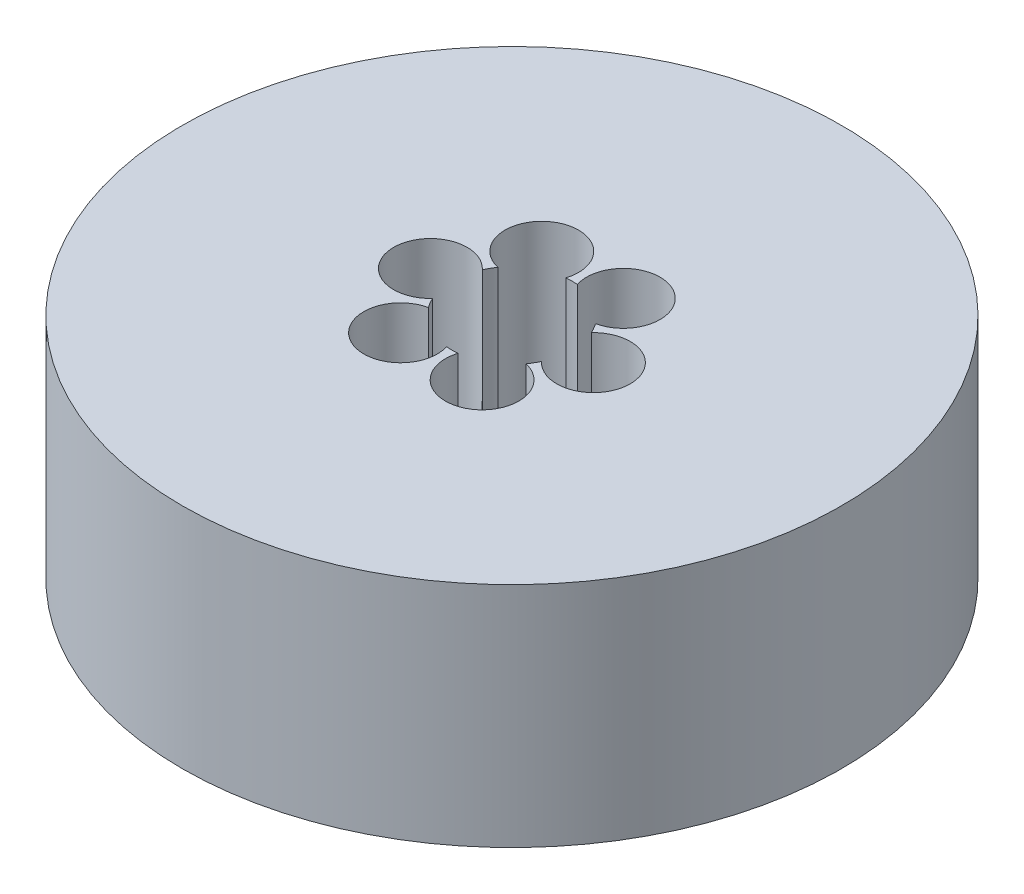
ISO-10303-21;
HEADER;
FILE_DESCRIPTION(('STEP AP214'),'2;1');
FILE_NAME('part.step','',(''),(''),'','','');
FILE_SCHEMA(('AUTOMOTIVE_DESIGN { 1 0 10303 214 1 1 1 1 }'));
ENDSEC;
DATA;
#1=APPLICATION_CONTEXT('core data for automotive mechanical design processes');
#2=APPLICATION_PROTOCOL_DEFINITION('international standard','automotive_design',2000,#1);
#3=PRODUCT_CONTEXT('',#1,'mechanical');
#4=PRODUCT('Part','Part','',(#3));
#5=PRODUCT_RELATED_PRODUCT_CATEGORY('part','',(#4));
#6=PRODUCT_DEFINITION_FORMATION('','',#4);
#7=PRODUCT_DEFINITION_CONTEXT('part definition',#1,'design');
#8=PRODUCT_DEFINITION('design','',#6,#7);
#9=PRODUCT_DEFINITION_SHAPE('','',#8);
#10=(LENGTH_UNIT() NAMED_UNIT(*) SI_UNIT(.MILLI.,.METRE.));
#11=(NAMED_UNIT(*) PLANE_ANGLE_UNIT() SI_UNIT($,.RADIAN.));
#12=(NAMED_UNIT(*) SI_UNIT($,.STERADIAN.) SOLID_ANGLE_UNIT());
#13=UNCERTAINTY_MEASURE_WITH_UNIT(LENGTH_MEASURE(1.E-05),#10,'distance_accuracy_value','');
#14=(GEOMETRIC_REPRESENTATION_CONTEXT(3) GLOBAL_UNCERTAINTY_ASSIGNED_CONTEXT((#13)) GLOBAL_UNIT_ASSIGNED_CONTEXT((#10,
#11,#12)) REPRESENTATION_CONTEXT('',''));
#15=CARTESIAN_POINT('',(0.,0.,0.));
#16=DIRECTION('',(0.,0.,1.));
#17=DIRECTION('',(1.,0.,0.));
#18=AXIS2_PLACEMENT_3D('',#15,#16,#17);
#19=CARTESIAN_POINT('',(0.,19.,0.));
#20=DIRECTION('',(0.,-1.,0.));
#21=DIRECTION('',(0.,0.,-1.));
#22=AXIS2_PLACEMENT_3D('',#19,#20,#21);
#23=CYLINDRICAL_SURFACE('',#22,27.5);
#24=CARTESIAN_POINT('',(0.,19.,0.));
#25=DIRECTION('',(0.,1.,0.));
#26=DIRECTION('',(0.,0.,1.));
#27=AXIS2_PLACEMENT_3D('',#24,#25,#26);
#28=CIRCLE('',#27,27.5);
#29=CARTESIAN_POINT('',(0.,19.,27.5));
#30=VERTEX_POINT('',#29);
#31=EDGE_CURVE('E168',#30,#30,#28,.T.);
#32=ORIENTED_EDGE('',*,*,#31,.F.);
#33=EDGE_LOOP('',(#32));
#34=FACE_BOUND('',#33,.T.);
#35=CARTESIAN_POINT('',(0.,0.,0.));
#36=DIRECTION('',(0.,1.,0.));
#37=DIRECTION('',(0.,0.,1.));
#38=AXIS2_PLACEMENT_3D('',#35,#36,#37);
#39=CIRCLE('',#38,27.5);
#40=CARTESIAN_POINT('',(0.,0.,27.5));
#41=VERTEX_POINT('',#40);
#42=EDGE_CURVE('E158',#41,#41,#39,.T.);
#43=ORIENTED_EDGE('',*,*,#42,.T.);
#44=EDGE_LOOP('',(#43));
#45=FACE_BOUND('',#44,.T.);
#46=ADVANCED_FACE('F39',(#34,#45),#23,.T.);
#47=CARTESIAN_POINT('',(0.,19.,0.));
#48=DIRECTION('',(0.,1.,0.));
#49=DIRECTION('',(0.,0.,1.));
#50=AXIS2_PLACEMENT_3D('',#47,#48,#49);
#51=PLANE('',#50);
#52=CARTESIAN_POINT('',(6.80324282315777,19.,0.));
#53=DIRECTION('',(0.,1.,0.));
#54=DIRECTION('',(0.,0.,-1.));
#55=AXIS2_PLACEMENT_3D('',#52,#53,#54);
#56=CIRCLE('',#55,3.06638386982698);
#57=CARTESIAN_POINT('',(4.5479343073771,19.,2.07756914103534));
#58=VERTEX_POINT('',#57);
#59=CARTESIAN_POINT('',(4.5479343073771,19.,-2.07756914103534));
#60=VERTEX_POINT('',#59);
#61=EDGE_CURVE('E212',#58,#60,#56,.T.);
#62=ORIENTED_EDGE('',*,*,#61,.F.);
#63=CARTESIAN_POINT('',(0.,19.,0.));
#64=DIRECTION('',(0.,1.,0.));
#65=DIRECTION('',(0.,0.,1.));
#66=AXIS2_PLACEMENT_3D('',#63,#64,#65);
#67=CIRCLE('',#66,5.);
#68=CARTESIAN_POINT('',(4.07319480794379,19.,2.89984207441367));
#69=VERTEX_POINT('',#68);
#70=EDGE_CURVE('E156',#69,#58,#67,.T.);
#71=ORIENTED_EDGE('',*,*,#70,.F.);
#72=CARTESIAN_POINT('',(3.40162141157891,19.,5.89178111296877));
#73=DIRECTION('',(0.,1.,0.));
#74=DIRECTION('',(0.866025403784436,0.,-0.500000000000004));
#75=AXIS2_PLACEMENT_3D('',#72,#73,#74);
#76=CIRCLE('',#75,3.06638386982698);
#77=CARTESIAN_POINT('',(0.474739499433353,19.,4.97741121544903));
#78=VERTEX_POINT('',#77);
#79=EDGE_CURVE('E152',#78,#69,#76,.T.);
#80=ORIENTED_EDGE('',*,*,#79,.F.);
#81=CARTESIAN_POINT('',(-0.474739499433319,19.,4.97741121544903));
#82=VERTEX_POINT('',#81);
#83=EDGE_CURVE('E148',#82,#78,#67,.T.);
#84=ORIENTED_EDGE('',*,*,#83,.F.);
#85=CARTESIAN_POINT('',(-3.40162141157887,19.,5.8917811129688));
#86=DIRECTION('',(0.,1.,0.));
#87=DIRECTION('',(0.86602540378444,0.,0.499999999999998));
#88=AXIS2_PLACEMENT_3D('',#85,#86,#87);
#89=CIRCLE('',#88,3.06638386982698);
#90=CARTESIAN_POINT('',(-4.07319480794377,19.,2.8998420744137));
#91=VERTEX_POINT('',#90);
#92=EDGE_CURVE('E127',#91,#82,#89,.T.);
#93=ORIENTED_EDGE('',*,*,#92,.F.);
#94=CARTESIAN_POINT('',(-4.5479343073771,19.,2.07756914103534));
#95=VERTEX_POINT('',#94);
#96=EDGE_CURVE('E154',#95,#91,#67,.T.);
#97=ORIENTED_EDGE('',*,*,#96,.F.);
#98=CARTESIAN_POINT('',(-6.80324282315777,19.,0.));
#99=DIRECTION('',(0.,1.,0.));
#100=DIRECTION('',(0.,0.,1.));
#101=AXIS2_PLACEMENT_3D('',#98,#99,#100);
#102=CIRCLE('',#101,3.06638386982698);
#103=CARTESIAN_POINT('',(-4.5479343073771,19.,-2.07756914103534));
#104=VERTEX_POINT('',#103);
#105=EDGE_CURVE('E163',#104,#95,#102,.T.);
#106=ORIENTED_EDGE('',*,*,#105,.F.);
#107=CARTESIAN_POINT('',(-4.07319480794381,19.,-2.89984207441364));
#108=VERTEX_POINT('',#107);
#109=EDGE_CURVE('E157',#108,#104,#67,.T.);
#110=ORIENTED_EDGE('',*,*,#109,.F.);
#111=CARTESIAN_POINT('',(-3.40162141157895,19.,-5.89178111296875));
#112=DIRECTION('',(0.,1.,0.));
#113=DIRECTION('',(-0.866025403784433,0.,0.50000000000001));
#114=AXIS2_PLACEMENT_3D('',#111,#112,#113);
#115=CIRCLE('',#114,3.06638386982698);
#116=CARTESIAN_POINT('',(-0.474739499433388,19.,-4.97741121544902));
#117=VERTEX_POINT('',#116);
#118=EDGE_CURVE('E371',#117,#108,#115,.T.);
#119=ORIENTED_EDGE('',*,*,#118,.F.);
#120=CARTESIAN_POINT('',(0.474739499433283,19.,-4.97741121544903));
#121=VERTEX_POINT('',#120);
#122=EDGE_CURVE('E378',#121,#117,#67,.T.);
#123=ORIENTED_EDGE('',*,*,#122,.F.);
#124=CARTESIAN_POINT('',(3.40162141157883,19.,-5.89178111296882));
#125=DIRECTION('',(0.,1.,0.));
#126=DIRECTION('',(-0.866025403784443,0.,-0.499999999999992));
#127=AXIS2_PLACEMENT_3D('',#124,#125,#126);
#128=CIRCLE('',#127,3.06638386982698);
#129=CARTESIAN_POINT('',(4.07319480794375,19.,-2.89984207441372));
#130=VERTEX_POINT('',#129);
#131=EDGE_CURVE('E392',#130,#121,#128,.T.);
#132=ORIENTED_EDGE('',*,*,#131,.F.);
#133=EDGE_CURVE('E161',#60,#130,#67,.T.);
#134=ORIENTED_EDGE('',*,*,#133,.F.);
#135=EDGE_LOOP('',(#62,#71,#80,#84,#93,#97,#106,#110,#119,#123,#132,#134));
#136=FACE_BOUND('',#135,.T.);
#137=ORIENTED_EDGE('',*,*,#31,.T.);
#138=EDGE_LOOP('',(#137));
#139=FACE_BOUND('',#138,.T.);
#140=ADVANCED_FACE('F151',(#136,#139),#51,.T.);
#141=CARTESIAN_POINT('',(0.,0.,0.));
#142=DIRECTION('',(0.,1.,0.));
#143=DIRECTION('',(0.,0.,1.));
#144=AXIS2_PLACEMENT_3D('',#141,#142,#143);
#145=PLANE('',#144);
#146=CARTESIAN_POINT('',(0.,0.,0.));
#147=DIRECTION('',(0.,1.,0.));
#148=DIRECTION('',(0.,0.,1.));
#149=AXIS2_PLACEMENT_3D('',#146,#147,#148);
#150=CIRCLE('',#149,5.);
#151=CARTESIAN_POINT('',(0.,0.,5.));
#152=VERTEX_POINT('',#151);
#153=EDGE_CURVE('E167',#152,#152,#150,.T.);
#154=ORIENTED_EDGE('',*,*,#153,.T.);
#155=EDGE_LOOP('',(#154));
#156=FACE_BOUND('',#155,.T.);
#157=ORIENTED_EDGE('',*,*,#42,.F.);
#158=EDGE_LOOP('',(#157));
#159=FACE_BOUND('',#158,.T.);
#160=ADVANCED_FACE('F235',(#156,#159),#145,.F.);
#161=CARTESIAN_POINT('',(0.,19.,0.));
#162=DIRECTION('',(0.,-1.,0.));
#163=DIRECTION('',(0.,0.,-1.));
#164=AXIS2_PLACEMENT_3D('',#161,#162,#163);
#165=CYLINDRICAL_SURFACE('',#164,5.);
#166=DIRECTION('',(0.,1.,0.));
#167=VECTOR('',#166,1.);
#168=CARTESIAN_POINT('',(4.5479343073771,10.8844741258261,2.07756914103534));
#169=LINE('',#168,#167);
#170=CARTESIAN_POINT('',(4.5479343073771,2.76894825165226,2.07756914103534));
#171=VERTEX_POINT('',#170);
#172=EDGE_CURVE('E11',#171,#58,#169,.T.);
#173=ORIENTED_EDGE('',*,*,#172,.F.);
#174=CARTESIAN_POINT('',(0.,2.76894825165226,0.));
#175=DIRECTION('',(0.,1.,0.));
#176=DIRECTION('',(0.,0.,1.));
#177=AXIS2_PLACEMENT_3D('',#174,#175,#176);
#178=CIRCLE('',#177,5.);
#179=CARTESIAN_POINT('',(4.5479343073771,2.76894825165226,-2.07756914103534));
#180=VERTEX_POINT('',#179);
#181=EDGE_CURVE('E207',#171,#180,#178,.T.);
#182=ORIENTED_EDGE('',*,*,#181,.T.);
#183=DIRECTION('',(0.,1.,0.));
#184=VECTOR('',#183,1.);
#185=CARTESIAN_POINT('',(4.5479343073771,10.8844741258261,-2.07756914103534));
#186=LINE('',#185,#184);
#187=EDGE_CURVE('E46',#60,#180,#186,.F.);
#188=ORIENTED_EDGE('',*,*,#187,.F.);
#189=ORIENTED_EDGE('',*,*,#133,.T.);
#190=DIRECTION('',(0.,1.,0.));
#191=VECTOR('',#190,1.);
#192=CARTESIAN_POINT('',(4.07319480794375,10.8844741258261,-2.89984207441372));
#193=LINE('',#192,#191);
#194=CARTESIAN_POINT('',(4.07319480794375,2.76894825165226,-2.89984207441372));
#195=VERTEX_POINT('',#194);
#196=EDGE_CURVE('E199',#195,#130,#193,.T.);
#197=ORIENTED_EDGE('',*,*,#196,.F.);
#198=CARTESIAN_POINT('',(0.,2.76894825165226,0.));
#199=DIRECTION('',(0.,1.,0.));
#200=DIRECTION('',(0.,0.,1.));
#201=AXIS2_PLACEMENT_3D('',#198,#199,#200);
#202=CIRCLE('',#201,5.);
#203=CARTESIAN_POINT('',(0.474739499433283,2.76894825165226,-4.97741121544903));
#204=VERTEX_POINT('',#203);
#205=EDGE_CURVE('E193',#195,#204,#202,.T.);
#206=ORIENTED_EDGE('',*,*,#205,.T.);
#207=DIRECTION('',(0.,1.,0.));
#208=VECTOR('',#207,1.);
#209=CARTESIAN_POINT('',(0.474739499433283,10.8844741258261,-4.97741121544903));
#210=LINE('',#209,#208);
#211=EDGE_CURVE('E197',#121,#204,#210,.F.);
#212=ORIENTED_EDGE('',*,*,#211,.F.);
#213=ORIENTED_EDGE('',*,*,#122,.T.);
#214=DIRECTION('',(0.,1.,0.));
#215=VECTOR('',#214,1.);
#216=CARTESIAN_POINT('',(-0.474739499433387,10.8844741258261,-4.97741121544902));
#217=LINE('',#216,#215);
#218=CARTESIAN_POINT('',(-0.474739499433388,2.76894825165226,-4.97741121544902));
#219=VERTEX_POINT('',#218);
#220=EDGE_CURVE('E195',#219,#117,#217,.T.);
#221=ORIENTED_EDGE('',*,*,#220,.F.);
#222=CARTESIAN_POINT('',(0.,2.76894825165226,0.));
#223=DIRECTION('',(0.,1.,0.));
#224=DIRECTION('',(0.,0.,1.));
#225=AXIS2_PLACEMENT_3D('',#222,#223,#224);
#226=CIRCLE('',#225,5.);
#227=CARTESIAN_POINT('',(-4.07319480794381,2.76894825165226,-2.89984207441364));
#228=VERTEX_POINT('',#227);
#229=EDGE_CURVE('E186',#219,#228,#226,.T.);
#230=ORIENTED_EDGE('',*,*,#229,.T.);
#231=DIRECTION('',(0.,1.,0.));
#232=VECTOR('',#231,1.);
#233=CARTESIAN_POINT('',(-4.07319480794381,10.8844741258261,-2.89984207441364));
#234=LINE('',#233,#232);
#235=EDGE_CURVE('E188',#108,#228,#234,.F.);
#236=ORIENTED_EDGE('',*,*,#235,.F.);
#237=ORIENTED_EDGE('',*,*,#109,.T.);
#238=DIRECTION('',(0.,1.,0.));
#239=VECTOR('',#238,1.);
#240=CARTESIAN_POINT('',(-4.5479343073771,10.8844741258261,-2.07756914103534));
#241=LINE('',#240,#239);
#242=CARTESIAN_POINT('',(-4.5479343073771,2.76894825165226,-2.07756914103534));
#243=VERTEX_POINT('',#242);
#244=EDGE_CURVE('E182',#243,#104,#241,.T.);
#245=ORIENTED_EDGE('',*,*,#244,.F.);
#246=CARTESIAN_POINT('',(0.,2.76894825165226,0.));
#247=DIRECTION('',(0.,1.,0.));
#248=DIRECTION('',(0.,0.,1.));
#249=AXIS2_PLACEMENT_3D('',#246,#247,#248);
#250=CIRCLE('',#249,5.);
#251=CARTESIAN_POINT('',(-4.5479343073771,2.76894825165226,2.07756914103534));
#252=VERTEX_POINT('',#251);
#253=EDGE_CURVE('E172',#243,#252,#250,.T.);
#254=ORIENTED_EDGE('',*,*,#253,.T.);
#255=DIRECTION('',(0.,1.,0.));
#256=VECTOR('',#255,1.);
#257=CARTESIAN_POINT('',(-4.5479343073771,10.8844741258261,2.07756914103534));
#258=LINE('',#257,#256);
#259=EDGE_CURVE('E177',#95,#252,#258,.F.);
#260=ORIENTED_EDGE('',*,*,#259,.F.);
#261=ORIENTED_EDGE('',*,*,#96,.T.);
#262=DIRECTION('',(0.,1.,0.));
#263=VECTOR('',#262,1.);
#264=CARTESIAN_POINT('',(-4.07319480794377,10.8844741258261,2.8998420744137));
#265=LINE('',#264,#263);
#266=CARTESIAN_POINT('',(-4.07319480794377,2.76894825165226,2.8998420744137));
#267=VERTEX_POINT('',#266);
#268=EDGE_CURVE('E132',#267,#91,#265,.T.);
#269=ORIENTED_EDGE('',*,*,#268,.F.);
#270=CARTESIAN_POINT('',(0.,2.76894825165226,0.));
#271=DIRECTION('',(0.,1.,0.));
#272=DIRECTION('',(0.,0.,1.));
#273=AXIS2_PLACEMENT_3D('',#270,#271,#272);
#274=CIRCLE('',#273,5.);
#275=CARTESIAN_POINT('',(-0.474739499433319,2.76894825165226,4.97741121544903));
#276=VERTEX_POINT('',#275);
#277=EDGE_CURVE('E150',#267,#276,#274,.T.);
#278=ORIENTED_EDGE('',*,*,#277,.T.);
#279=DIRECTION('',(0.,1.,0.));
#280=VECTOR('',#279,1.);
#281=CARTESIAN_POINT('',(-0.474739499433318,10.8844741258261,4.97741121544903));
#282=LINE('',#281,#280);
#283=EDGE_CURVE('E128',#82,#276,#282,.F.);
#284=ORIENTED_EDGE('',*,*,#283,.F.);
#285=ORIENTED_EDGE('',*,*,#83,.T.);
#286=DIRECTION('',(0.,1.,0.));
#287=VECTOR('',#286,1.);
#288=CARTESIAN_POINT('',(0.474739499433353,10.8844741258261,4.97741121544903));
#289=LINE('',#288,#287);
#290=CARTESIAN_POINT('',(0.474739499433353,2.76894825165226,4.97741121544903));
#291=VERTEX_POINT('',#290);
#292=EDGE_CURVE('E210',#291,#78,#289,.T.);
#293=ORIENTED_EDGE('',*,*,#292,.F.);
#294=CARTESIAN_POINT('',(0.,2.76894825165226,0.));
#295=DIRECTION('',(0.,1.,0.));
#296=DIRECTION('',(0.,0.,1.));
#297=AXIS2_PLACEMENT_3D('',#294,#295,#296);
#298=CIRCLE('',#297,5.);
#299=CARTESIAN_POINT('',(4.07319480794379,2.76894825165226,2.89984207441367));
#300=VERTEX_POINT('',#299);
#301=EDGE_CURVE('E205',#291,#300,#298,.T.);
#302=ORIENTED_EDGE('',*,*,#301,.T.);
#303=DIRECTION('',(0.,1.,0.));
#304=VECTOR('',#303,1.);
#305=CARTESIAN_POINT('',(4.07319480794379,10.8844741258261,2.89984207441367));
#306=LINE('',#305,#304);
#307=EDGE_CURVE('E202',#69,#300,#306,.F.);
#308=ORIENTED_EDGE('',*,*,#307,.F.);
#309=ORIENTED_EDGE('',*,*,#70,.T.);
#310=EDGE_LOOP('',(#173,#182,#188,#189,#197,#206,#212,#213,#221,#230,#236,#237,#245,#254,#260,
#261,#269,#278,#284,#285,#293,#302,#308,#309));
#311=FACE_BOUND('',#310,.T.);
#312=ORIENTED_EDGE('',*,*,#153,.F.);
#313=EDGE_LOOP('',(#312));
#314=FACE_BOUND('',#313,.T.);
#315=ADVANCED_FACE('F141',(#311,#314),#165,.F.);
#316=CARTESIAN_POINT('',(-6.80324282315777,2.76894825165226,0.));
#317=DIRECTION('',(0.,1.,0.));
#318=DIRECTION('',(0.,0.,1.));
#319=AXIS2_PLACEMENT_3D('',#316,#317,#318);
#320=CYLINDRICAL_SURFACE('',#319,3.06638386982698);
#321=ORIENTED_EDGE('',*,*,#244,.T.);
#322=ORIENTED_EDGE('',*,*,#105,.T.);
#323=ORIENTED_EDGE('',*,*,#259,.T.);
#324=CARTESIAN_POINT('',(-6.80324282315777,2.76894825165226,0.));
#325=DIRECTION('',(0.,1.,0.));
#326=DIRECTION('',(0.,0.,1.));
#327=AXIS2_PLACEMENT_3D('',#324,#325,#326);
#328=CIRCLE('',#327,3.06638386982698);
#329=EDGE_CURVE('E166',#243,#252,#328,.T.);
#330=ORIENTED_EDGE('',*,*,#329,.F.);
#331=EDGE_LOOP('',(#321,#322,#323,#330));
#332=FACE_BOUND('',#331,.T.);
#333=ADVANCED_FACE('F242',(#332),#320,.F.);
#334=CARTESIAN_POINT('',(-6.80324282315777,2.76894825165226,0.));
#335=DIRECTION('',(0.,1.,0.));
#336=DIRECTION('',(0.,0.,1.));
#337=AXIS2_PLACEMENT_3D('',#334,#335,#336);
#338=PLANE('',#337);
#339=ORIENTED_EDGE('',*,*,#329,.T.);
#340=ORIENTED_EDGE('',*,*,#253,.F.);
#341=EDGE_LOOP('',(#339,#340));
#342=FACE_BOUND('',#341,.T.);
#343=ADVANCED_FACE('F250',(#342),#338,.T.);
#344=CARTESIAN_POINT('',(-3.40162141157887,2.76894825165226,5.8917811129688));
#345=DIRECTION('',(0.,1.,0.));
#346=DIRECTION('',(0.,0.,1.));
#347=AXIS2_PLACEMENT_3D('',#344,#345,#346);
#348=CYLINDRICAL_SURFACE('',#347,3.06638386982698);
#349=ORIENTED_EDGE('',*,*,#268,.T.);
#350=ORIENTED_EDGE('',*,*,#92,.T.);
#351=ORIENTED_EDGE('',*,*,#283,.T.);
#352=CARTESIAN_POINT('',(-3.40162141157887,2.76894825165226,5.8917811129688));
#353=DIRECTION('',(0.,1.,0.));
#354=DIRECTION('',(0.86602540378444,0.,0.499999999999998));
#355=AXIS2_PLACEMENT_3D('',#352,#353,#354);
#356=CIRCLE('',#355,3.06638386982698);
#357=EDGE_CURVE('E137',#267,#276,#356,.T.);
#358=ORIENTED_EDGE('',*,*,#357,.F.);
#359=EDGE_LOOP('',(#349,#350,#351,#358));
#360=FACE_BOUND('',#359,.T.);
#361=ADVANCED_FACE('F126',(#360),#348,.F.);
#362=CARTESIAN_POINT('',(-3.40162141157887,2.76894825165226,5.8917811129688));
#363=DIRECTION('',(0.,1.,0.));
#364=DIRECTION('',(0.86602540378444,0.,0.499999999999998));
#365=AXIS2_PLACEMENT_3D('',#362,#363,#364);
#366=PLANE('',#365);
#367=ORIENTED_EDGE('',*,*,#357,.T.);
#368=ORIENTED_EDGE('',*,*,#277,.F.);
#369=EDGE_LOOP('',(#367,#368));
#370=FACE_BOUND('',#369,.T.);
#371=ADVANCED_FACE('F255',(#370),#366,.T.);
#372=CARTESIAN_POINT('',(-3.40162141157895,2.76894825165226,-5.89178111296875));
#373=DIRECTION('',(0.,1.,0.));
#374=DIRECTION('',(0.,0.,1.));
#375=AXIS2_PLACEMENT_3D('',#372,#373,#374);
#376=CYLINDRICAL_SURFACE('',#375,3.06638386982698);
#377=ORIENTED_EDGE('',*,*,#220,.T.);
#378=ORIENTED_EDGE('',*,*,#118,.T.);
#379=ORIENTED_EDGE('',*,*,#235,.T.);
#380=CARTESIAN_POINT('',(-3.40162141157895,2.76894825165226,-5.89178111296875));
#381=DIRECTION('',(0.,1.,0.));
#382=DIRECTION('',(-0.866025403784433,0.,0.50000000000001));
#383=AXIS2_PLACEMENT_3D('',#380,#381,#382);
#384=CIRCLE('',#383,3.06638386982698);
#385=EDGE_CURVE('E373',#219,#228,#384,.T.);
#386=ORIENTED_EDGE('',*,*,#385,.F.);
#387=EDGE_LOOP('',(#377,#378,#379,#386));
#388=FACE_BOUND('',#387,.T.);
#389=ADVANCED_FACE('F260',(#388),#376,.F.);
#390=CARTESIAN_POINT('',(-3.40162141157895,2.76894825165226,-5.89178111296875));
#391=DIRECTION('',(0.,1.,0.));
#392=DIRECTION('',(-0.866025403784433,0.,0.50000000000001));
#393=AXIS2_PLACEMENT_3D('',#390,#391,#392);
#394=PLANE('',#393);
#395=ORIENTED_EDGE('',*,*,#385,.T.);
#396=ORIENTED_EDGE('',*,*,#229,.F.);
#397=EDGE_LOOP('',(#395,#396));
#398=FACE_BOUND('',#397,.T.);
#399=ADVANCED_FACE('F301',(#398),#394,.T.);
#400=CARTESIAN_POINT('',(3.40162141157883,2.76894825165226,-5.89178111296882));
#401=DIRECTION('',(0.,1.,0.));
#402=DIRECTION('',(0.,0.,1.));
#403=AXIS2_PLACEMENT_3D('',#400,#401,#402);
#404=CYLINDRICAL_SURFACE('',#403,3.06638386982698);
#405=ORIENTED_EDGE('',*,*,#196,.T.);
#406=ORIENTED_EDGE('',*,*,#131,.T.);
#407=ORIENTED_EDGE('',*,*,#211,.T.);
#408=CARTESIAN_POINT('',(3.40162141157883,2.76894825165226,-5.89178111296882));
#409=DIRECTION('',(0.,1.,0.));
#410=DIRECTION('',(-0.866025403784443,0.,-0.499999999999992));
#411=AXIS2_PLACEMENT_3D('',#408,#409,#410);
#412=CIRCLE('',#411,3.06638386982698);
#413=EDGE_CURVE('E388',#195,#204,#412,.T.);
#414=ORIENTED_EDGE('',*,*,#413,.F.);
#415=EDGE_LOOP('',(#405,#406,#407,#414));
#416=FACE_BOUND('',#415,.T.);
#417=ADVANCED_FACE('F295',(#416),#404,.F.);
#418=CARTESIAN_POINT('',(3.40162141157883,2.76894825165226,-5.89178111296882));
#419=DIRECTION('',(0.,1.,0.));
#420=DIRECTION('',(-0.866025403784443,0.,-0.499999999999992));
#421=AXIS2_PLACEMENT_3D('',#418,#419,#420);
#422=PLANE('',#421);
#423=ORIENTED_EDGE('',*,*,#413,.T.);
#424=ORIENTED_EDGE('',*,*,#205,.F.);
#425=EDGE_LOOP('',(#423,#424));
#426=FACE_BOUND('',#425,.T.);
#427=ADVANCED_FACE('F265',(#426),#422,.T.);
#428=CARTESIAN_POINT('',(3.40162141157891,2.76894825165226,5.89178111296877));
#429=DIRECTION('',(0.,1.,0.));
#430=DIRECTION('',(0.,0.,1.));
#431=AXIS2_PLACEMENT_3D('',#428,#429,#430);
#432=CYLINDRICAL_SURFACE('',#431,3.06638386982698);
#433=ORIENTED_EDGE('',*,*,#292,.T.);
#434=ORIENTED_EDGE('',*,*,#79,.T.);
#435=ORIENTED_EDGE('',*,*,#307,.T.);
#436=CARTESIAN_POINT('',(3.40162141157891,2.76894825165226,5.89178111296877));
#437=DIRECTION('',(0.,1.,0.));
#438=DIRECTION('',(0.866025403784436,0.,-0.500000000000004));
#439=AXIS2_PLACEMENT_3D('',#436,#437,#438);
#440=CIRCLE('',#439,3.06638386982698);
#441=EDGE_CURVE('E56',#291,#300,#440,.T.);
#442=ORIENTED_EDGE('',*,*,#441,.F.);
#443=EDGE_LOOP('',(#433,#434,#435,#442));
#444=FACE_BOUND('',#443,.T.);
#445=ADVANCED_FACE('F259',(#444),#432,.F.);
#446=CARTESIAN_POINT('',(3.40162141157891,2.76894825165226,5.89178111296877));
#447=DIRECTION('',(0.,1.,0.));
#448=DIRECTION('',(0.866025403784436,0.,-0.500000000000004));
#449=AXIS2_PLACEMENT_3D('',#446,#447,#448);
#450=PLANE('',#449);
#451=ORIENTED_EDGE('',*,*,#441,.T.);
#452=ORIENTED_EDGE('',*,*,#301,.F.);
#453=EDGE_LOOP('',(#451,#452));
#454=FACE_BOUND('',#453,.T.);
#455=ADVANCED_FACE('F224',(#454),#450,.T.);
#456=CARTESIAN_POINT('',(6.80324282315777,2.76894825165226,0.));
#457=DIRECTION('',(0.,1.,0.));
#458=DIRECTION('',(0.,0.,1.));
#459=AXIS2_PLACEMENT_3D('',#456,#457,#458);
#460=CYLINDRICAL_SURFACE('',#459,3.06638386982698);
#461=ORIENTED_EDGE('',*,*,#172,.T.);
#462=ORIENTED_EDGE('',*,*,#61,.T.);
#463=ORIENTED_EDGE('',*,*,#187,.T.);
#464=CARTESIAN_POINT('',(6.80324282315777,2.76894825165226,0.));
#465=DIRECTION('',(0.,1.,0.));
#466=DIRECTION('',(0.,0.,-1.));
#467=AXIS2_PLACEMENT_3D('',#464,#465,#466);
#468=CIRCLE('',#467,3.06638386982698);
#469=EDGE_CURVE('E55',#171,#180,#468,.T.);
#470=ORIENTED_EDGE('',*,*,#469,.F.);
#471=EDGE_LOOP('',(#461,#462,#463,#470));
#472=FACE_BOUND('',#471,.T.);
#473=ADVANCED_FACE('F213',(#472),#460,.F.);
#474=CARTESIAN_POINT('',(6.80324282315777,2.76894825165226,0.));
#475=DIRECTION('',(0.,1.,0.));
#476=DIRECTION('',(0.,0.,-1.));
#477=AXIS2_PLACEMENT_3D('',#474,#475,#476);
#478=PLANE('',#477);
#479=ORIENTED_EDGE('',*,*,#469,.T.);
#480=ORIENTED_EDGE('',*,*,#181,.F.);
#481=EDGE_LOOP('',(#479,#480));
#482=FACE_BOUND('',#481,.T.);
#483=ADVANCED_FACE('F220',(#482),#478,.T.);
#484=CLOSED_SHELL('',(#46,#140,#160,#315,#333,#343,#361,#371,#389,#399,#417,#427,#445,#455,#473,#483));
#485=MANIFOLD_SOLID_BREP('B2',#484);
#486=ADVANCED_BREP_SHAPE_REPRESENTATION('',(#18,#485),#14);
#487=SHAPE_DEFINITION_REPRESENTATION(#9,#486);
ENDSEC;
END-ISO-10303-21;
